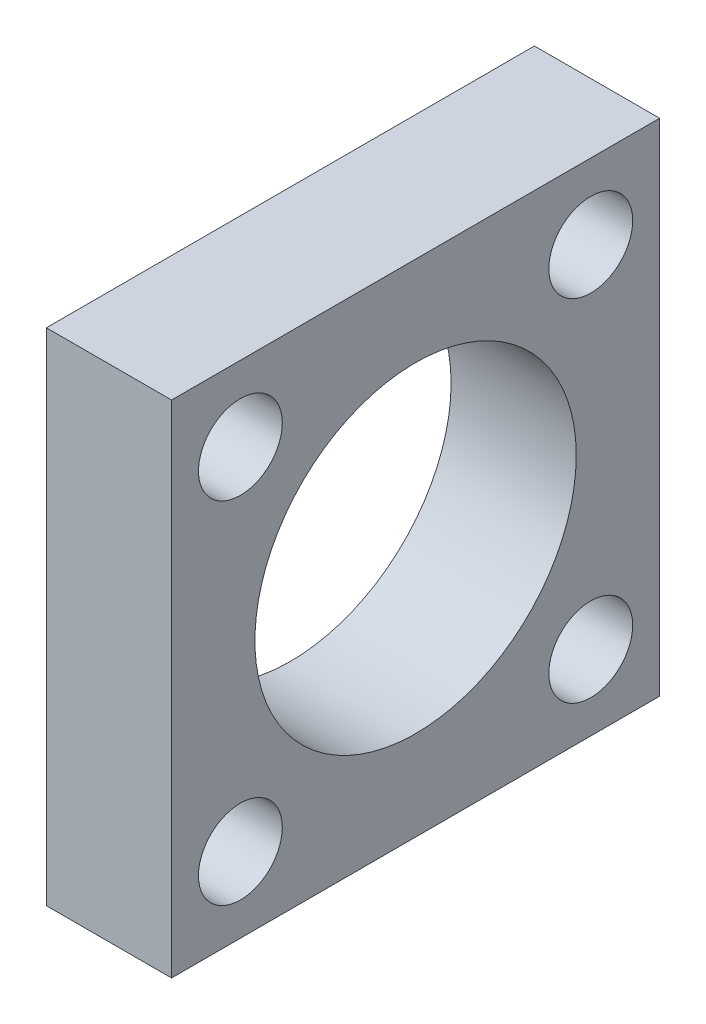
ISO-10303-21;
HEADER;
FILE_DESCRIPTION(('STEP AP214'),'2;1');
FILE_NAME('part.step','',(''),(''),'','','');
FILE_SCHEMA(('AUTOMOTIVE_DESIGN { 1 0 10303 214 1 1 1 1 }'));
ENDSEC;
DATA;
#1=APPLICATION_CONTEXT('core data for automotive mechanical design processes');
#2=APPLICATION_PROTOCOL_DEFINITION('international standard','automotive_design',2000,#1);
#3=PRODUCT_CONTEXT('',#1,'mechanical');
#4=PRODUCT('Part','Part','',(#3));
#5=PRODUCT_RELATED_PRODUCT_CATEGORY('part','',(#4));
#6=PRODUCT_DEFINITION_FORMATION('','',#4);
#7=PRODUCT_DEFINITION_CONTEXT('part definition',#1,'design');
#8=PRODUCT_DEFINITION('design','',#6,#7);
#9=PRODUCT_DEFINITION_SHAPE('','',#8);
#10=(LENGTH_UNIT() NAMED_UNIT(*) SI_UNIT(.MILLI.,.METRE.));
#11=(NAMED_UNIT(*) PLANE_ANGLE_UNIT() SI_UNIT($,.RADIAN.));
#12=(NAMED_UNIT(*) SI_UNIT($,.STERADIAN.) SOLID_ANGLE_UNIT());
#13=UNCERTAINTY_MEASURE_WITH_UNIT(LENGTH_MEASURE(1.E-05),#10,'distance_accuracy_value','');
#14=(GEOMETRIC_REPRESENTATION_CONTEXT(3) GLOBAL_UNCERTAINTY_ASSIGNED_CONTEXT((#13)) GLOBAL_UNIT_ASSIGNED_CONTEXT((#10,
#11,#12)) REPRESENTATION_CONTEXT('',''));
#15=CARTESIAN_POINT('',(0.,0.,0.));
#16=DIRECTION('',(0.,0.,1.));
#17=DIRECTION('',(1.,0.,0.));
#18=AXIS2_PLACEMENT_3D('',#15,#16,#17);
#19=CARTESIAN_POINT('',(10.,0.,0.));
#20=DIRECTION('',(1.,0.,0.));
#21=DIRECTION('',(0.,0.,-1.));
#22=AXIS2_PLACEMENT_3D('',#19,#20,#21);
#23=PLANE('',#22);
#24=CARTESIAN_POINT('',(10.,-22.9938146044063,-17.4092586947485));
#25=DIRECTION('',(1.,0.,0.));
#26=DIRECTION('',(0.,0.,-1.));
#27=AXIS2_PLACEMENT_3D('',#24,#25,#26);
#28=CIRCLE('',#27,3.35000000000003);
#29=CARTESIAN_POINT('',(10.,-22.9938146044063,-20.7592586947486));
#30=VERTEX_POINT('',#29);
#31=EDGE_CURVE('E105',#30,#30,#28,.T.);
#32=ORIENTED_EDGE('',*,*,#31,.F.);
#33=EDGE_LOOP('',(#32));
#34=FACE_BOUND('',#33,.T.);
#35=CARTESIAN_POINT('',(10.,-22.9938146044063,10.5907413052515));
#36=DIRECTION('',(1.,0.,0.));
#37=DIRECTION('',(0.,0.,-1.));
#38=AXIS2_PLACEMENT_3D('',#35,#36,#37);
#39=CIRCLE('',#38,3.35000000000001);
#40=CARTESIAN_POINT('',(10.,-22.9938146044063,7.24074130525146));
#41=VERTEX_POINT('',#40);
#42=EDGE_CURVE('E112',#41,#41,#39,.F.);
#43=ORIENTED_EDGE('',*,*,#42,.T.);
#44=EDGE_LOOP('',(#43));
#45=FACE_BOUND('',#44,.T.);
#46=CARTESIAN_POINT('',(10.,-8.99381460440626,-3.40925869474853));
#47=DIRECTION('',(1.,0.,0.));
#48=DIRECTION('',(0.,0.,-1.));
#49=AXIS2_PLACEMENT_3D('',#46,#47,#48);
#50=CIRCLE('',#49,12.8397);
#51=CARTESIAN_POINT('',(10.,-8.99381460440626,-16.2489586947485));
#52=VERTEX_POINT('',#51);
#53=EDGE_CURVE('E128',#52,#52,#50,.T.);
#54=ORIENTED_EDGE('',*,*,#53,.F.);
#55=EDGE_LOOP('',(#54));
#56=FACE_BOUND('',#55,.T.);
#57=DIRECTION('',(0.,-1.,0.));
#58=VECTOR('',#57,1.);
#59=CARTESIAN_POINT('',(10.,11.0061853955937,16.0907413052515));
#60=LINE('',#59,#58);
#61=CARTESIAN_POINT('',(10.,11.0061853955937,16.0907413052515));
#62=VERTEX_POINT('',#61);
#63=CARTESIAN_POINT('',(10.,-28.9938146044063,16.0907413052515));
#64=VERTEX_POINT('',#63);
#65=EDGE_CURVE('E132',#62,#64,#60,.T.);
#66=ORIENTED_EDGE('',*,*,#65,.T.);
#67=DIRECTION('',(0.,0.,-1.));
#68=VECTOR('',#67,1.);
#69=CARTESIAN_POINT('',(10.,-28.9938146044063,16.0907413052515));
#70=LINE('',#69,#68);
#71=CARTESIAN_POINT('',(10.,-28.9938146044063,-22.9092586947485));
#72=VERTEX_POINT('',#71);
#73=EDGE_CURVE('E81',#64,#72,#70,.T.);
#74=ORIENTED_EDGE('',*,*,#73,.T.);
#75=DIRECTION('',(0.,-1.,0.));
#76=VECTOR('',#75,1.);
#77=CARTESIAN_POINT('',(10.,11.0061853955937,-22.9092586947485));
#78=LINE('',#77,#76);
#79=CARTESIAN_POINT('',(10.,11.0061853955937,-22.9092586947485));
#80=VERTEX_POINT('',#79);
#81=EDGE_CURVE('E136',#80,#72,#78,.T.);
#82=ORIENTED_EDGE('',*,*,#81,.F.);
#83=DIRECTION('',(0.,0.,-1.));
#84=VECTOR('',#83,1.);
#85=CARTESIAN_POINT('',(10.,11.0061853955937,16.0907413052515));
#86=LINE('',#85,#84);
#87=EDGE_CURVE('E139',#62,#80,#86,.T.);
#88=ORIENTED_EDGE('',*,*,#87,.F.);
#89=EDGE_LOOP('',(#66,#74,#82,#88));
#90=FACE_BOUND('',#89,.T.);
#91=CARTESIAN_POINT('',(10.,5.00618539559373,-17.4092586947485));
#92=DIRECTION('',(1.,0.,0.));
#93=DIRECTION('',(0.,0.,-1.));
#94=AXIS2_PLACEMENT_3D('',#91,#92,#93);
#95=CIRCLE('',#94,3.35000000000003);
#96=CARTESIAN_POINT('',(10.,5.00618539559373,-20.7592586947486));
#97=VERTEX_POINT('',#96);
#98=EDGE_CURVE('E109',#97,#97,#95,.F.);
#99=ORIENTED_EDGE('',*,*,#98,.T.);
#100=EDGE_LOOP('',(#99));
#101=FACE_BOUND('',#100,.T.);
#102=CARTESIAN_POINT('',(10.,5.00618539559373,10.5907413052515));
#103=DIRECTION('',(1.,0.,0.));
#104=DIRECTION('',(0.,0.,-1.));
#105=AXIS2_PLACEMENT_3D('',#102,#103,#104);
#106=CIRCLE('',#105,3.35);
#107=CARTESIAN_POINT('',(10.,5.00618539559373,7.24074130525147));
#108=VERTEX_POINT('',#107);
#109=EDGE_CURVE('E96',#108,#108,#106,.T.);
#110=ORIENTED_EDGE('',*,*,#109,.F.);
#111=EDGE_LOOP('',(#110));
#112=FACE_BOUND('',#111,.T.);
#113=ADVANCED_FACE('F38',(#34,#45,#56,#90,#101,#112),#23,.T.);
#114=CARTESIAN_POINT('',(0.,0.,0.));
#115=DIRECTION('',(1.,0.,0.));
#116=DIRECTION('',(0.,0.,-1.));
#117=AXIS2_PLACEMENT_3D('',#114,#115,#116);
#118=PLANE('',#117);
#119=CARTESIAN_POINT('',(0.,5.00618539559373,-17.4092586947485));
#120=DIRECTION('',(-1.,0.,0.));
#121=DIRECTION('',(0.,0.,1.));
#122=AXIS2_PLACEMENT_3D('',#119,#120,#121);
#123=CIRCLE('',#122,3.35000000000003);
#124=CARTESIAN_POINT('',(0.,5.00618539559373,-14.0592586947485));
#125=VERTEX_POINT('',#124);
#126=EDGE_CURVE('E115',#125,#125,#123,.T.);
#127=ORIENTED_EDGE('',*,*,#126,.F.);
#128=EDGE_LOOP('',(#127));
#129=FACE_BOUND('',#128,.T.);
#130=CARTESIAN_POINT('',(0.,-22.9938146044063,10.5907413052515));
#131=DIRECTION('',(-1.,0.,0.));
#132=DIRECTION('',(0.,0.,1.));
#133=AXIS2_PLACEMENT_3D('',#130,#131,#132);
#134=CIRCLE('',#133,3.35000000000001);
#135=CARTESIAN_POINT('',(0.,-22.9938146044063,13.9407413052515));
#136=VERTEX_POINT('',#135);
#137=EDGE_CURVE('E120',#136,#136,#134,.T.);
#138=ORIENTED_EDGE('',*,*,#137,.F.);
#139=EDGE_LOOP('',(#138));
#140=FACE_BOUND('',#139,.T.);
#141=CARTESIAN_POINT('',(0.,-8.99381460440626,-3.40925869474853));
#142=DIRECTION('',(1.,0.,0.));
#143=DIRECTION('',(0.,0.,-1.));
#144=AXIS2_PLACEMENT_3D('',#141,#142,#143);
#145=CIRCLE('',#144,12.8397);
#146=CARTESIAN_POINT('',(0.,-8.99381460440626,-16.2489586947485));
#147=VERTEX_POINT('',#146);
#148=EDGE_CURVE('E123',#147,#147,#145,.T.);
#149=ORIENTED_EDGE('',*,*,#148,.T.);
#150=EDGE_LOOP('',(#149));
#151=FACE_BOUND('',#150,.T.);
#152=DIRECTION('',(0.,-1.,0.));
#153=VECTOR('',#152,1.);
#154=CARTESIAN_POINT('',(0.,11.0061853955937,16.0907413052515));
#155=LINE('',#154,#153);
#156=CARTESIAN_POINT('',(0.,11.0061853955937,16.0907413052515));
#157=VERTEX_POINT('',#156);
#158=CARTESIAN_POINT('',(0.,-28.9938146044063,16.0907413052515));
#159=VERTEX_POINT('',#158);
#160=EDGE_CURVE('E131',#157,#159,#155,.T.);
#161=ORIENTED_EDGE('',*,*,#160,.F.);
#162=DIRECTION('',(0.,0.,-1.));
#163=VECTOR('',#162,1.);
#164=CARTESIAN_POINT('',(0.,11.0061853955937,16.0907413052515));
#165=LINE('',#164,#163);
#166=CARTESIAN_POINT('',(0.,11.0061853955937,-22.9092586947485));
#167=VERTEX_POINT('',#166);
#168=EDGE_CURVE('E134',#157,#167,#165,.T.);
#169=ORIENTED_EDGE('',*,*,#168,.T.);
#170=DIRECTION('',(0.,-1.,0.));
#171=VECTOR('',#170,1.);
#172=CARTESIAN_POINT('',(0.,11.0061853955937,-22.9092586947485));
#173=LINE('',#172,#171);
#174=CARTESIAN_POINT('',(0.,-28.9938146044063,-22.9092586947485));
#175=VERTEX_POINT('',#174);
#176=EDGE_CURVE('E145',#167,#175,#173,.T.);
#177=ORIENTED_EDGE('',*,*,#176,.T.);
#178=DIRECTION('',(0.,0.,-1.));
#179=VECTOR('',#178,1.);
#180=CARTESIAN_POINT('',(0.,-28.9938146044063,16.0907413052515));
#181=LINE('',#180,#179);
#182=EDGE_CURVE('E142',#159,#175,#181,.T.);
#183=ORIENTED_EDGE('',*,*,#182,.F.);
#184=EDGE_LOOP('',(#161,#169,#177,#183));
#185=FACE_BOUND('',#184,.T.);
#186=CARTESIAN_POINT('',(0.,-22.9938146044063,-17.4092586947485));
#187=DIRECTION('',(1.,0.,0.));
#188=DIRECTION('',(0.,0.,-1.));
#189=AXIS2_PLACEMENT_3D('',#186,#187,#188);
#190=CIRCLE('',#189,3.35000000000003);
#191=CARTESIAN_POINT('',(0.,-22.9938146044063,-20.7592586947486));
#192=VERTEX_POINT('',#191);
#193=EDGE_CURVE('E108',#192,#192,#190,.T.);
#194=ORIENTED_EDGE('',*,*,#193,.T.);
#195=EDGE_LOOP('',(#194));
#196=FACE_BOUND('',#195,.T.);
#197=CARTESIAN_POINT('',(0.,5.00618539559373,10.5907413052515));
#198=DIRECTION('',(1.,0.,0.));
#199=DIRECTION('',(0.,0.,-1.));
#200=AXIS2_PLACEMENT_3D('',#197,#198,#199);
#201=CIRCLE('',#200,3.35);
#202=CARTESIAN_POINT('',(0.,5.00618539559373,7.24074130525147));
#203=VERTEX_POINT('',#202);
#204=EDGE_CURVE('E100',#203,#203,#201,.T.);
#205=ORIENTED_EDGE('',*,*,#204,.T.);
#206=EDGE_LOOP('',(#205));
#207=FACE_BOUND('',#206,.T.);
#208=ADVANCED_FACE('F157',(#129,#140,#151,#185,#196,#207),#118,.F.);
#209=CARTESIAN_POINT('',(10.,11.0061853955937,16.0907413052515));
#210=DIRECTION('',(0.,0.,-1.));
#211=DIRECTION('',(-1.,0.,0.));
#212=AXIS2_PLACEMENT_3D('',#209,#210,#211);
#213=PLANE('',#212);
#214=ORIENTED_EDGE('',*,*,#160,.T.);
#215=DIRECTION('',(-1.,0.,0.));
#216=VECTOR('',#215,1.);
#217=CARTESIAN_POINT('',(10.,-28.9938146044063,16.0907413052515));
#218=LINE('',#217,#216);
#219=EDGE_CURVE('E11',#64,#159,#218,.T.);
#220=ORIENTED_EDGE('',*,*,#219,.F.);
#221=ORIENTED_EDGE('',*,*,#65,.F.);
#222=DIRECTION('',(-1.,0.,0.));
#223=VECTOR('',#222,1.);
#224=CARTESIAN_POINT('',(10.,11.0061853955937,16.0907413052515));
#225=LINE('',#224,#223);
#226=EDGE_CURVE('E55',#62,#157,#225,.T.);
#227=ORIENTED_EDGE('',*,*,#226,.T.);
#228=EDGE_LOOP('',(#214,#220,#221,#227));
#229=FACE_BOUND('',#228,.T.);
#230=ADVANCED_FACE('F40',(#229),#213,.F.);
#231=CARTESIAN_POINT('',(10.,-28.9938146044063,16.0907413052515));
#232=DIRECTION('',(0.,1.,0.));
#233=DIRECTION('',(0.,0.,1.));
#234=AXIS2_PLACEMENT_3D('',#231,#232,#233);
#235=PLANE('',#234);
#236=CARTESIAN_POINT('',(5.,-28.9938146044063,-9.90925869474854));
#237=DIRECTION('',(0.,-1.,0.));
#238=DIRECTION('',(0.,0.,-1.));
#239=AXIS2_PLACEMENT_3D('',#236,#237,#238);
#240=CIRCLE('',#239,1.72719999999999);
#241=CARTESIAN_POINT('',(5.,-28.9938146044063,-11.6364586947485));
#242=VERTEX_POINT('',#241);
#243=EDGE_CURVE('E97',#242,#242,#240,.T.);
#244=ORIENTED_EDGE('',*,*,#243,.F.);
#245=EDGE_LOOP('',(#244));
#246=FACE_BOUND('',#245,.T.);
#247=ORIENTED_EDGE('',*,*,#182,.T.);
#248=DIRECTION('',(-1.,0.,0.));
#249=VECTOR('',#248,1.);
#250=CARTESIAN_POINT('',(10.,-28.9938146044063,-22.9092586947485));
#251=LINE('',#250,#249);
#252=EDGE_CURVE('E47',#72,#175,#251,.T.);
#253=ORIENTED_EDGE('',*,*,#252,.F.);
#254=ORIENTED_EDGE('',*,*,#73,.F.);
#255=ORIENTED_EDGE('',*,*,#219,.T.);
#256=EDGE_LOOP('',(#247,#253,#254,#255));
#257=FACE_BOUND('',#256,.T.);
#258=ADVANCED_FACE('F154',(#246,#257),#235,.F.);
#259=CARTESIAN_POINT('',(10.,11.0061853955937,-22.9092586947485));
#260=DIRECTION('',(0.,0.,-1.));
#261=DIRECTION('',(0.,1.,0.));
#262=AXIS2_PLACEMENT_3D('',#259,#260,#261);
#263=PLANE('',#262);
#264=ORIENTED_EDGE('',*,*,#176,.F.);
#265=DIRECTION('',(-1.,0.,0.));
#266=VECTOR('',#265,1.);
#267=CARTESIAN_POINT('',(10.,11.0061853955937,-22.9092586947485));
#268=LINE('',#267,#266);
#269=EDGE_CURVE('E70',#80,#167,#268,.T.);
#270=ORIENTED_EDGE('',*,*,#269,.F.);
#271=ORIENTED_EDGE('',*,*,#81,.T.);
#272=ORIENTED_EDGE('',*,*,#252,.T.);
#273=EDGE_LOOP('',(#264,#270,#271,#272));
#274=FACE_BOUND('',#273,.T.);
#275=ADVANCED_FACE('F152',(#274),#263,.T.);
#276=CARTESIAN_POINT('',(10.,11.0061853955937,16.0907413052515));
#277=DIRECTION('',(0.,1.,0.));
#278=DIRECTION('',(0.,0.,1.));
#279=AXIS2_PLACEMENT_3D('',#276,#277,#278);
#280=PLANE('',#279);
#281=ORIENTED_EDGE('',*,*,#168,.F.);
#282=ORIENTED_EDGE('',*,*,#226,.F.);
#283=ORIENTED_EDGE('',*,*,#87,.T.);
#284=ORIENTED_EDGE('',*,*,#269,.T.);
#285=EDGE_LOOP('',(#281,#282,#283,#284));
#286=FACE_BOUND('',#285,.T.);
#287=ADVANCED_FACE('F159',(#286),#280,.T.);
#288=CARTESIAN_POINT('',(10.001,-8.99381460440626,-3.40925869474853));
#289=DIRECTION('',(-1.,0.,0.));
#290=DIRECTION('',(0.,0.,1.));
#291=AXIS2_PLACEMENT_3D('',#288,#289,#290);
#292=CYLINDRICAL_SURFACE('',#291,12.8397);
#293=ORIENTED_EDGE('',*,*,#53,.T.);
#294=EDGE_LOOP('',(#293));
#295=FACE_BOUND('',#294,.T.);
#296=ORIENTED_EDGE('',*,*,#148,.F.);
#297=EDGE_LOOP('',(#296));
#298=FACE_BOUND('',#297,.T.);
#299=ADVANCED_FACE('F161',(#295,#298),#292,.F.);
#300=CARTESIAN_POINT('',(10.001,-22.9938146044063,10.5907413052515));
#301=DIRECTION('',(-1.,0.,0.));
#302=DIRECTION('',(0.,0.,1.));
#303=AXIS2_PLACEMENT_3D('',#300,#301,#302);
#304=CYLINDRICAL_SURFACE('',#303,3.35000000000001);
#305=ORIENTED_EDGE('',*,*,#42,.F.);
#306=EDGE_LOOP('',(#305));
#307=FACE_BOUND('',#306,.T.);
#308=ORIENTED_EDGE('',*,*,#137,.T.);
#309=EDGE_LOOP('',(#308));
#310=FACE_BOUND('',#309,.T.);
#311=ADVANCED_FACE('F167',(#307,#310),#304,.F.);
#312=CARTESIAN_POINT('',(10.001,-22.9938146044063,-17.4092586947485));
#313=DIRECTION('',(-1.,0.,0.));
#314=DIRECTION('',(0.,0.,1.));
#315=AXIS2_PLACEMENT_3D('',#312,#313,#314);
#316=CYLINDRICAL_SURFACE('',#315,3.35000000000003);
#317=ORIENTED_EDGE('',*,*,#31,.T.);
#318=EDGE_LOOP('',(#317));
#319=FACE_BOUND('',#318,.T.);
#320=ORIENTED_EDGE('',*,*,#193,.F.);
#321=EDGE_LOOP('',(#320));
#322=FACE_BOUND('',#321,.T.);
#323=ADVANCED_FACE('F184',(#319,#322),#316,.F.);
#324=CARTESIAN_POINT('',(10.001,5.00618539559373,-17.4092586947485));
#325=DIRECTION('',(-1.,0.,0.));
#326=DIRECTION('',(0.,0.,1.));
#327=AXIS2_PLACEMENT_3D('',#324,#325,#326);
#328=CYLINDRICAL_SURFACE('',#327,3.35000000000003);
#329=ORIENTED_EDGE('',*,*,#98,.F.);
#330=EDGE_LOOP('',(#329));
#331=FACE_BOUND('',#330,.T.);
#332=ORIENTED_EDGE('',*,*,#126,.T.);
#333=EDGE_LOOP('',(#332));
#334=FACE_BOUND('',#333,.T.);
#335=ADVANCED_FACE('F188',(#331,#334),#328,.F.);
#336=CARTESIAN_POINT('',(10.001,5.00618539559373,10.5907413052515));
#337=DIRECTION('',(-1.,0.,0.));
#338=DIRECTION('',(0.,0.,1.));
#339=AXIS2_PLACEMENT_3D('',#336,#337,#338);
#340=CYLINDRICAL_SURFACE('',#339,3.35);
#341=ORIENTED_EDGE('',*,*,#109,.T.);
#342=EDGE_LOOP('',(#341));
#343=FACE_BOUND('',#342,.T.);
#344=ORIENTED_EDGE('',*,*,#204,.F.);
#345=EDGE_LOOP('',(#344));
#346=FACE_BOUND('',#345,.T.);
#347=ADVANCED_FACE('F90',(#343,#346),#340,.F.);
#348=CARTESIAN_POINT('',(5.,-22.9938146044063,-9.90925869474854));
#349=DIRECTION('',(0.,-1.,0.));
#350=DIRECTION('',(0.,0.,-1.));
#351=AXIS2_PLACEMENT_3D('',#348,#349,#350);
#352=CONICAL_SURFACE('',#351,1.7272,1.02974425867665);
#353=CARTESIAN_POINT('',(5.,-21.9560081432219,-9.90925869474854));
#354=VERTEX_POINT('',#353);
#355=VERTEX_LOOP('',#354);
#356=FACE_BOUND('',#355,.T.);
#357=CARTESIAN_POINT('',(5.,-22.9938146044063,-9.90925869474854));
#358=DIRECTION('',(0.,-1.,0.));
#359=DIRECTION('',(0.,0.,-1.));
#360=AXIS2_PLACEMENT_3D('',#357,#358,#359);
#361=CIRCLE('',#360,1.7272);
#362=CARTESIAN_POINT('',(5.,-22.9938146044063,-11.6364586947485));
#363=VERTEX_POINT('',#362);
#364=EDGE_CURVE('E94',#363,#363,#361,.T.);
#365=ORIENTED_EDGE('',*,*,#364,.T.);
#366=EDGE_LOOP('',(#365));
#367=FACE_BOUND('',#366,.T.);
#368=ADVANCED_FACE('F86',(#356,#367),#352,.F.);
#369=CARTESIAN_POINT('',(5.,-28.9938146044063,-9.90925869474854));
#370=DIRECTION('',(0.,-1.,0.));
#371=DIRECTION('',(0.,0.,-1.));
#372=AXIS2_PLACEMENT_3D('',#369,#370,#371);
#373=CYLINDRICAL_SURFACE('',#372,1.72719999999999);
#374=ORIENTED_EDGE('',*,*,#364,.F.);
#375=EDGE_LOOP('',(#374));
#376=FACE_BOUND('',#375,.T.);
#377=ORIENTED_EDGE('',*,*,#243,.T.);
#378=EDGE_LOOP('',(#377));
#379=FACE_BOUND('',#378,.T.);
#380=ADVANCED_FACE('F89',(#376,#379),#373,.F.);
#381=CLOSED_SHELL('',(#113,#208,#230,#258,#275,#287,#299,#311,#323,#335,#347,#368,#380));
#382=MANIFOLD_SOLID_BREP('B2',#381);
#383=ADVANCED_BREP_SHAPE_REPRESENTATION('',(#18,#382),#14);
#384=SHAPE_DEFINITION_REPRESENTATION(#9,#383);
ENDSEC;
END-ISO-10303-21;
